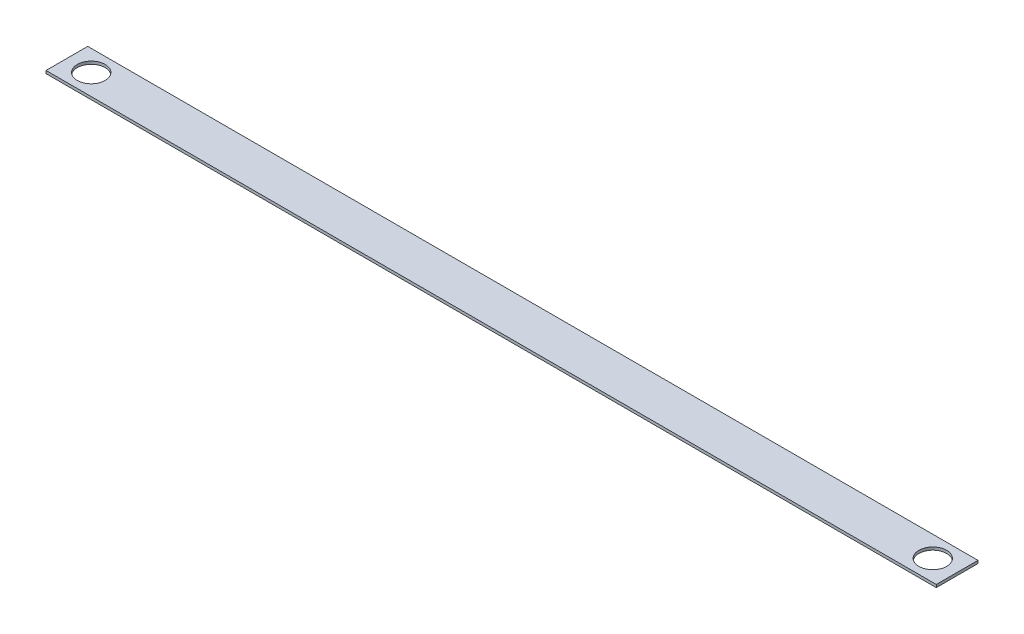
ISO-10303-21;
HEADER;
FILE_DESCRIPTION(('STEP AP214'),'2;1');
FILE_NAME('part.step','',(''),(''),'','','');
FILE_SCHEMA(('AUTOMOTIVE_DESIGN { 1 0 10303 214 1 1 1 1 }'));
ENDSEC;
DATA;
#1=APPLICATION_CONTEXT('core data for automotive mechanical design processes');
#2=APPLICATION_PROTOCOL_DEFINITION('international standard','automotive_design',2000,#1);
#3=PRODUCT_CONTEXT('',#1,'mechanical');
#4=PRODUCT('Part','Part','',(#3));
#5=PRODUCT_RELATED_PRODUCT_CATEGORY('part','',(#4));
#6=PRODUCT_DEFINITION_FORMATION('','',#4);
#7=PRODUCT_DEFINITION_CONTEXT('part definition',#1,'design');
#8=PRODUCT_DEFINITION('design','',#6,#7);
#9=PRODUCT_DEFINITION_SHAPE('','',#8);
#10=(LENGTH_UNIT() NAMED_UNIT(*) SI_UNIT(.MILLI.,.METRE.));
#11=(NAMED_UNIT(*) PLANE_ANGLE_UNIT() SI_UNIT($,.RADIAN.));
#12=(NAMED_UNIT(*) SI_UNIT($,.STERADIAN.) SOLID_ANGLE_UNIT());
#13=UNCERTAINTY_MEASURE_WITH_UNIT(LENGTH_MEASURE(1.E-05),#10,'distance_accuracy_value','');
#14=(GEOMETRIC_REPRESENTATION_CONTEXT(3) GLOBAL_UNCERTAINTY_ASSIGNED_CONTEXT((#13)) GLOBAL_UNIT_ASSIGNED_CONTEXT((#10,
#11,#12)) REPRESENTATION_CONTEXT('',''));
#15=CARTESIAN_POINT('',(0.,0.,0.));
#16=DIRECTION('',(0.,0.,1.));
#17=DIRECTION('',(1.,0.,0.));
#18=AXIS2_PLACEMENT_3D('',#15,#16,#17);
#19=CARTESIAN_POINT('',(-406.4,2.54,19.0500000000001));
#20=DIRECTION('',(1.,0.,0.));
#21=DIRECTION('',(0.,0.,-1.));
#22=AXIS2_PLACEMENT_3D('',#19,#20,#21);
#23=PLANE('',#22);
#24=DIRECTION('',(0.,0.,1.));
#25=VECTOR('',#24,1.);
#26=CARTESIAN_POINT('',(-406.4,0.,19.0500000000001));
#27=LINE('',#26,#25);
#28=CARTESIAN_POINT('',(-406.4,0.,-19.05));
#29=VERTEX_POINT('',#28);
#30=CARTESIAN_POINT('',(-406.4,0.,19.0500000000001));
#31=VERTEX_POINT('',#30);
#32=EDGE_CURVE('E96',#29,#31,#27,.T.);
#33=ORIENTED_EDGE('',*,*,#32,.T.);
#34=DIRECTION('',(0.,-1.,0.));
#35=VECTOR('',#34,1.);
#36=CARTESIAN_POINT('',(-406.4,2.54,19.0500000000001));
#37=LINE('',#36,#35);
#38=CARTESIAN_POINT('',(-406.4,2.54,19.0500000000001));
#39=VERTEX_POINT('',#38);
#40=EDGE_CURVE('E11',#39,#31,#37,.T.);
#41=ORIENTED_EDGE('',*,*,#40,.F.);
#42=DIRECTION('',(0.,0.,1.));
#43=VECTOR('',#42,1.);
#44=CARTESIAN_POINT('',(-406.4,2.54,19.0500000000001));
#45=LINE('',#44,#43);
#46=CARTESIAN_POINT('',(-406.4,2.54,-19.05));
#47=VERTEX_POINT('',#46);
#48=EDGE_CURVE('E84',#47,#39,#45,.T.);
#49=ORIENTED_EDGE('',*,*,#48,.F.);
#50=DIRECTION('',(0.,-1.,0.));
#51=VECTOR('',#50,1.);
#52=CARTESIAN_POINT('',(-406.4,2.54,-19.05));
#53=LINE('',#52,#51);
#54=EDGE_CURVE('E92',#47,#29,#53,.T.);
#55=ORIENTED_EDGE('',*,*,#54,.T.);
#56=EDGE_LOOP('',(#33,#41,#49,#55));
#57=FACE_BOUND('',#56,.T.);
#58=ADVANCED_FACE('F33',(#57),#23,.F.);
#59=CARTESIAN_POINT('',(406.4,2.54,19.05));
#60=DIRECTION('',(0.,0.,-1.));
#61=DIRECTION('',(-1.,0.,0.));
#62=AXIS2_PLACEMENT_3D('',#59,#60,#61);
#63=PLANE('',#62);
#64=DIRECTION('',(1.,0.,0.));
#65=VECTOR('',#64,1.);
#66=CARTESIAN_POINT('',(406.4,0.,19.05));
#67=LINE('',#66,#65);
#68=CARTESIAN_POINT('',(406.4,0.,19.05));
#69=VERTEX_POINT('',#68);
#70=EDGE_CURVE('E88',#31,#69,#67,.T.);
#71=ORIENTED_EDGE('',*,*,#70,.T.);
#72=DIRECTION('',(0.,-1.,0.));
#73=VECTOR('',#72,1.);
#74=CARTESIAN_POINT('',(406.4,2.54,19.05));
#75=LINE('',#74,#73);
#76=CARTESIAN_POINT('',(406.4,2.54,19.05));
#77=VERTEX_POINT('',#76);
#78=EDGE_CURVE('E41',#77,#69,#75,.T.);
#79=ORIENTED_EDGE('',*,*,#78,.F.);
#80=DIRECTION('',(1.,0.,0.));
#81=VECTOR('',#80,1.);
#82=CARTESIAN_POINT('',(406.4,2.54,19.05));
#83=LINE('',#82,#81);
#84=EDGE_CURVE('E79',#39,#77,#83,.T.);
#85=ORIENTED_EDGE('',*,*,#84,.F.);
#86=ORIENTED_EDGE('',*,*,#40,.T.);
#87=EDGE_LOOP('',(#71,#79,#85,#86));
#88=FACE_BOUND('',#87,.T.);
#89=ADVANCED_FACE('F87',(#88),#63,.F.);
#90=CARTESIAN_POINT('',(406.4,2.54,19.05));
#91=DIRECTION('',(-1.,0.,0.));
#92=DIRECTION('',(0.,0.,1.));
#93=AXIS2_PLACEMENT_3D('',#90,#91,#92);
#94=PLANE('',#93);
#95=DIRECTION('',(0.,0.,-1.));
#96=VECTOR('',#95,1.);
#97=CARTESIAN_POINT('',(406.4,0.,19.05));
#98=LINE('',#97,#96);
#99=CARTESIAN_POINT('',(406.4,0.,-19.0500000000001));
#100=VERTEX_POINT('',#99);
#101=EDGE_CURVE('E66',#69,#100,#98,.T.);
#102=ORIENTED_EDGE('',*,*,#101,.T.);
#103=DIRECTION('',(0.,-1.,0.));
#104=VECTOR('',#103,1.);
#105=CARTESIAN_POINT('',(406.4,2.54,-19.0500000000001));
#106=LINE('',#105,#104);
#107=CARTESIAN_POINT('',(406.4,2.54,-19.0500000000001));
#108=VERTEX_POINT('',#107);
#109=EDGE_CURVE('E89',#108,#100,#106,.T.);
#110=ORIENTED_EDGE('',*,*,#109,.F.);
#111=DIRECTION('',(0.,0.,-1.));
#112=VECTOR('',#111,1.);
#113=CARTESIAN_POINT('',(406.4,2.54,19.05));
#114=LINE('',#113,#112);
#115=EDGE_CURVE('E82',#77,#108,#114,.T.);
#116=ORIENTED_EDGE('',*,*,#115,.F.);
#117=ORIENTED_EDGE('',*,*,#78,.T.);
#118=EDGE_LOOP('',(#102,#110,#116,#117));
#119=FACE_BOUND('',#118,.T.);
#120=ADVANCED_FACE('F90',(#119),#94,.F.);
#121=CARTESIAN_POINT('',(406.4,2.54,-19.0500000000001));
#122=DIRECTION('',(0.,0.,1.));
#123=DIRECTION('',(1.,0.,0.));
#124=AXIS2_PLACEMENT_3D('',#121,#122,#123);
#125=PLANE('',#124);
#126=DIRECTION('',(-1.,0.,0.));
#127=VECTOR('',#126,1.);
#128=CARTESIAN_POINT('',(406.4,0.,-19.0500000000001));
#129=LINE('',#128,#127);
#130=EDGE_CURVE('E72',#100,#29,#129,.T.);
#131=ORIENTED_EDGE('',*,*,#130,.T.);
#132=ORIENTED_EDGE('',*,*,#54,.F.);
#133=DIRECTION('',(-1.,0.,0.));
#134=VECTOR('',#133,1.);
#135=CARTESIAN_POINT('',(406.4,2.54,-19.0500000000001));
#136=LINE('',#135,#134);
#137=EDGE_CURVE('E49',#108,#47,#136,.T.);
#138=ORIENTED_EDGE('',*,*,#137,.F.);
#139=ORIENTED_EDGE('',*,*,#109,.T.);
#140=EDGE_LOOP('',(#131,#132,#138,#139));
#141=FACE_BOUND('',#140,.T.);
#142=ADVANCED_FACE('F104',(#141),#125,.F.);
#143=CARTESIAN_POINT('',(0.,2.54,0.));
#144=DIRECTION('',(0.,1.,0.));
#145=DIRECTION('',(0.,0.,1.));
#146=AXIS2_PLACEMENT_3D('',#143,#144,#145);
#147=PLANE('',#146);
#148=CARTESIAN_POINT('',(-384.175,2.54,0.));
#149=DIRECTION('',(0.,1.,0.));
#150=DIRECTION('',(0.,0.,1.));
#151=AXIS2_PLACEMENT_3D('',#148,#149,#150);
#152=CIRCLE('',#151,12.7);
#153=CARTESIAN_POINT('',(-384.175,2.54,12.7000000000001));
#154=VERTEX_POINT('',#153);
#155=EDGE_CURVE('E99',#154,#154,#152,.T.);
#156=ORIENTED_EDGE('',*,*,#155,.F.);
#157=EDGE_LOOP('',(#156));
#158=FACE_BOUND('',#157,.T.);
#159=CARTESIAN_POINT('',(384.175,2.54,-1.40754779860001E-13));
#160=DIRECTION('',(0.,1.,0.));
#161=DIRECTION('',(0.,0.,1.));
#162=AXIS2_PLACEMENT_3D('',#159,#160,#161);
#163=CIRCLE('',#162,12.7);
#164=CARTESIAN_POINT('',(384.175,2.54,12.6999999999999));
#165=VERTEX_POINT('',#164);
#166=EDGE_CURVE('E112',#165,#165,#163,.T.);
#167=ORIENTED_EDGE('',*,*,#166,.F.);
#168=EDGE_LOOP('',(#167));
#169=FACE_BOUND('',#168,.T.);
#170=ORIENTED_EDGE('',*,*,#48,.T.);
#171=ORIENTED_EDGE('',*,*,#84,.T.);
#172=ORIENTED_EDGE('',*,*,#115,.T.);
#173=ORIENTED_EDGE('',*,*,#137,.T.);
#174=EDGE_LOOP('',(#170,#171,#172,#173));
#175=FACE_BOUND('',#174,.T.);
#176=ADVANCED_FACE('F80',(#158,#169,#175),#147,.T.);
#177=CARTESIAN_POINT('',(0.,0.,0.));
#178=DIRECTION('',(0.,1.,0.));
#179=DIRECTION('',(0.,0.,1.));
#180=AXIS2_PLACEMENT_3D('',#177,#178,#179);
#181=PLANE('',#180);
#182=CARTESIAN_POINT('',(-384.175,0.,0.));
#183=DIRECTION('',(0.,1.,0.));
#184=DIRECTION('',(0.,0.,1.));
#185=AXIS2_PLACEMENT_3D('',#182,#183,#184);
#186=CIRCLE('',#185,12.7);
#187=CARTESIAN_POINT('',(-384.175,0.,12.7000000000001));
#188=VERTEX_POINT('',#187);
#189=EDGE_CURVE('E115',#188,#188,#186,.T.);
#190=ORIENTED_EDGE('',*,*,#189,.T.);
#191=EDGE_LOOP('',(#190));
#192=FACE_BOUND('',#191,.T.);
#193=CARTESIAN_POINT('',(384.175,0.,-1.40754779860001E-13));
#194=DIRECTION('',(0.,1.,0.));
#195=DIRECTION('',(0.,0.,1.));
#196=AXIS2_PLACEMENT_3D('',#193,#194,#195);
#197=CIRCLE('',#196,12.7);
#198=CARTESIAN_POINT('',(384.175,0.,12.6999999999999));
#199=VERTEX_POINT('',#198);
#200=EDGE_CURVE('E116',#199,#199,#197,.T.);
#201=ORIENTED_EDGE('',*,*,#200,.T.);
#202=EDGE_LOOP('',(#201));
#203=FACE_BOUND('',#202,.T.);
#204=ORIENTED_EDGE('',*,*,#32,.F.);
#205=ORIENTED_EDGE('',*,*,#130,.F.);
#206=ORIENTED_EDGE('',*,*,#101,.F.);
#207=ORIENTED_EDGE('',*,*,#70,.F.);
#208=EDGE_LOOP('',(#204,#205,#206,#207));
#209=FACE_BOUND('',#208,.T.);
#210=ADVANCED_FACE('F107',(#192,#203,#209),#181,.F.);
#211=CARTESIAN_POINT('',(384.175,0.,-1.40754779860001E-13));
#212=DIRECTION('',(0.,1.,0.));
#213=DIRECTION('',(0.,0.,1.));
#214=AXIS2_PLACEMENT_3D('',#211,#212,#213);
#215=CYLINDRICAL_SURFACE('',#214,12.7);
#216=ORIENTED_EDGE('',*,*,#166,.T.);
#217=EDGE_LOOP('',(#216));
#218=FACE_BOUND('',#217,.T.);
#219=ORIENTED_EDGE('',*,*,#200,.F.);
#220=EDGE_LOOP('',(#219));
#221=FACE_BOUND('',#220,.T.);
#222=ADVANCED_FACE('F126',(#218,#221),#215,.F.);
#223=CARTESIAN_POINT('',(-384.175,0.,0.));
#224=DIRECTION('',(0.,1.,0.));
#225=DIRECTION('',(0.,0.,1.));
#226=AXIS2_PLACEMENT_3D('',#223,#224,#225);
#227=CYLINDRICAL_SURFACE('',#226,12.7);
#228=ORIENTED_EDGE('',*,*,#155,.T.);
#229=EDGE_LOOP('',(#228));
#230=FACE_BOUND('',#229,.T.);
#231=ORIENTED_EDGE('',*,*,#189,.F.);
#232=EDGE_LOOP('',(#231));
#233=FACE_BOUND('',#232,.T.);
#234=ADVANCED_FACE('F124',(#230,#233),#227,.F.);
#235=CLOSED_SHELL('',(#58,#89,#120,#142,#176,#210,#222,#234));
#236=MANIFOLD_SOLID_BREP('B2',#235);
#237=ADVANCED_BREP_SHAPE_REPRESENTATION('',(#18,#236),#14);
#238=SHAPE_DEFINITION_REPRESENTATION(#9,#237);
ENDSEC;
END-ISO-10303-21;
